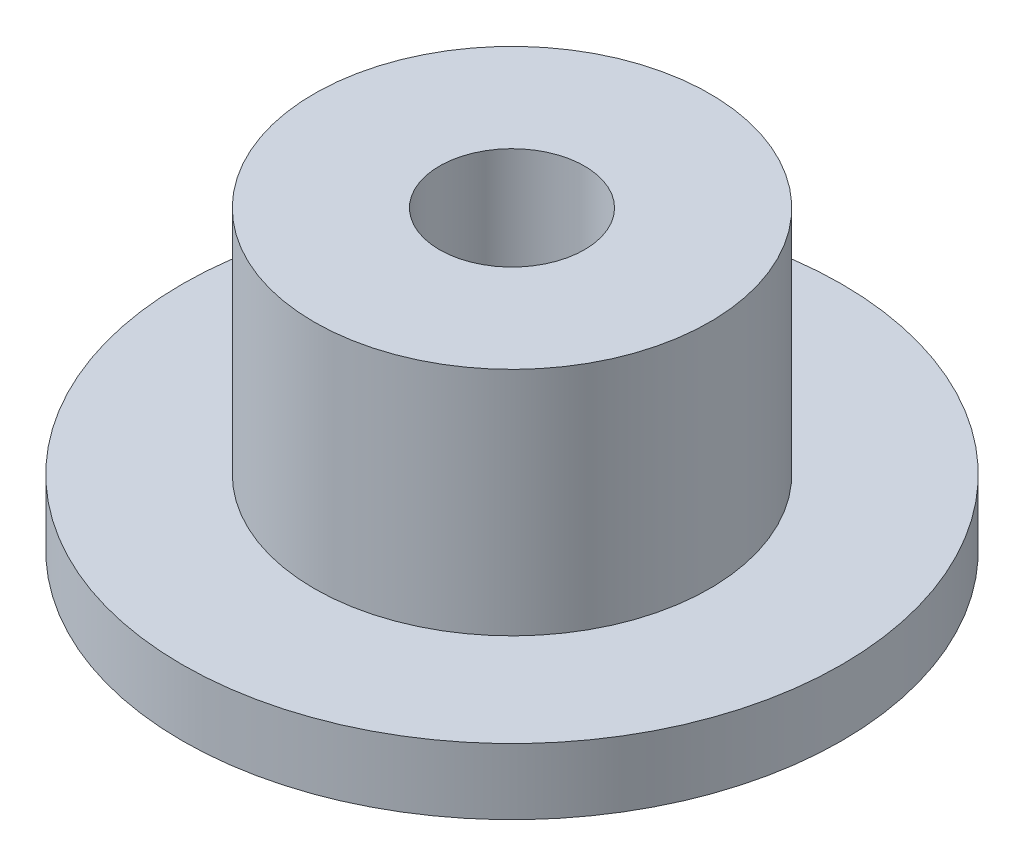
ISO-10303-21;
HEADER;
FILE_DESCRIPTION(('STEP AP214'),'2;1');
FILE_NAME('part.step','',(''),(''),'','','');
FILE_SCHEMA(('AUTOMOTIVE_DESIGN { 1 0 10303 214 1 1 1 1 }'));
ENDSEC;
DATA;
#1=APPLICATION_CONTEXT('core data for automotive mechanical design processes');
#2=APPLICATION_PROTOCOL_DEFINITION('international standard','automotive_design',2000,#1);
#3=PRODUCT_CONTEXT('',#1,'mechanical');
#4=PRODUCT('Part','Part','',(#3));
#5=PRODUCT_RELATED_PRODUCT_CATEGORY('part','',(#4));
#6=PRODUCT_DEFINITION_FORMATION('','',#4);
#7=PRODUCT_DEFINITION_CONTEXT('part definition',#1,'design');
#8=PRODUCT_DEFINITION('design','',#6,#7);
#9=PRODUCT_DEFINITION_SHAPE('','',#8);
#10=(LENGTH_UNIT() NAMED_UNIT(*) SI_UNIT(.MILLI.,.METRE.));
#11=(NAMED_UNIT(*) PLANE_ANGLE_UNIT() SI_UNIT($,.RADIAN.));
#12=(NAMED_UNIT(*) SI_UNIT($,.STERADIAN.) SOLID_ANGLE_UNIT());
#13=UNCERTAINTY_MEASURE_WITH_UNIT(LENGTH_MEASURE(1.E-05),#10,'distance_accuracy_value','');
#14=(GEOMETRIC_REPRESENTATION_CONTEXT(3) GLOBAL_UNCERTAINTY_ASSIGNED_CONTEXT((#13)) GLOBAL_UNIT_ASSIGNED_CONTEXT((#10,
#11,#12)) REPRESENTATION_CONTEXT('',''));
#15=CARTESIAN_POINT('',(0.,0.,0.));
#16=DIRECTION('',(0.,0.,1.));
#17=DIRECTION('',(1.,0.,0.));
#18=AXIS2_PLACEMENT_3D('',#15,#16,#17);
#19=CARTESIAN_POINT('',(6.,9.,0.));
#20=DIRECTION('',(0.,-1.,0.));
#21=DIRECTION('',(0.,0.,-1.));
#22=AXIS2_PLACEMENT_3D('',#19,#20,#21);
#23=PLANE('',#22);
#24=CARTESIAN_POINT('',(0.,9.,0.));
#25=DIRECTION('',(0.,1.,0.));
#26=DIRECTION('',(0.,0.,1.));
#27=AXIS2_PLACEMENT_3D('',#24,#25,#26);
#28=CIRCLE('',#27,2.2);
#29=CARTESIAN_POINT('',(0.,9.,2.2));
#30=VERTEX_POINT('',#29);
#31=EDGE_CURVE('E10',#30,#30,#28,.T.);
#32=ORIENTED_EDGE('',*,*,#31,.F.);
#33=EDGE_LOOP('',(#32));
#34=FACE_BOUND('',#33,.T.);
#35=CARTESIAN_POINT('',(0.,9.,0.));
#36=DIRECTION('',(0.,1.,0.));
#37=DIRECTION('',(0.,0.,1.));
#38=AXIS2_PLACEMENT_3D('',#35,#36,#37);
#39=CIRCLE('',#38,6.);
#40=CARTESIAN_POINT('',(0.,9.,6.));
#41=VERTEX_POINT('',#40);
#42=EDGE_CURVE('E80',#41,#41,#39,.T.);
#43=ORIENTED_EDGE('',*,*,#42,.T.);
#44=EDGE_LOOP('',(#43));
#45=FACE_BOUND('',#44,.T.);
#46=ADVANCED_FACE('F37',(#34,#45),#23,.F.);
#47=CARTESIAN_POINT('',(0.,11.7190903959677,0.));
#48=DIRECTION('',(0.,1.,0.));
#49=DIRECTION('',(0.,0.,1.));
#50=AXIS2_PLACEMENT_3D('',#47,#48,#49);
#51=CYLINDRICAL_SURFACE('',#50,2.2);
#52=CARTESIAN_POINT('',(0.,3.,0.));
#53=DIRECTION('',(0.,1.,0.));
#54=DIRECTION('',(0.,0.,1.));
#55=AXIS2_PLACEMENT_3D('',#52,#53,#54);
#56=CIRCLE('',#55,2.2);
#57=CARTESIAN_POINT('',(0.,3.,2.2));
#58=VERTEX_POINT('',#57);
#59=EDGE_CURVE('E44',#58,#58,#56,.T.);
#60=ORIENTED_EDGE('',*,*,#59,.F.);
#61=EDGE_LOOP('',(#60));
#62=FACE_BOUND('',#61,.T.);
#63=ORIENTED_EDGE('',*,*,#31,.T.);
#64=EDGE_LOOP('',(#63));
#65=FACE_BOUND('',#64,.T.);
#66=ADVANCED_FACE('F130',(#62,#65),#51,.F.);
#67=CARTESIAN_POINT('',(2.2,3.,0.));
#68=DIRECTION('',(0.,1.,0.));
#69=DIRECTION('',(0.,0.,1.));
#70=AXIS2_PLACEMENT_3D('',#67,#68,#69);
#71=PLANE('',#70);
#72=CARTESIAN_POINT('',(0.,3.,0.));
#73=DIRECTION('',(0.,1.,0.));
#74=DIRECTION('',(0.,0.,1.));
#75=AXIS2_PLACEMENT_3D('',#72,#73,#74);
#76=CIRCLE('',#75,4.1);
#77=CARTESIAN_POINT('',(0.,3.,4.1));
#78=VERTEX_POINT('',#77);
#79=EDGE_CURVE('E49',#78,#78,#76,.T.);
#80=ORIENTED_EDGE('',*,*,#79,.F.);
#81=EDGE_LOOP('',(#80));
#82=FACE_BOUND('',#81,.T.);
#83=ORIENTED_EDGE('',*,*,#59,.T.);
#84=EDGE_LOOP('',(#83));
#85=FACE_BOUND('',#84,.T.);
#86=ADVANCED_FACE('F125',(#82,#85),#71,.F.);
#87=CARTESIAN_POINT('',(0.,11.7190903959677,0.));
#88=DIRECTION('',(0.,1.,0.));
#89=DIRECTION('',(0.,0.,1.));
#90=AXIS2_PLACEMENT_3D('',#87,#88,#89);
#91=CYLINDRICAL_SURFACE('',#90,4.1);
#92=CARTESIAN_POINT('',(0.,0.6,0.));
#93=DIRECTION('',(0.,1.,0.));
#94=DIRECTION('',(0.,0.,1.));
#95=AXIS2_PLACEMENT_3D('',#92,#93,#94);
#96=CIRCLE('',#95,4.1);
#97=CARTESIAN_POINT('',(0.,0.6,4.1));
#98=VERTEX_POINT('',#97);
#99=EDGE_CURVE('E54',#98,#98,#96,.T.);
#100=ORIENTED_EDGE('',*,*,#99,.F.);
#101=EDGE_LOOP('',(#100));
#102=FACE_BOUND('',#101,.T.);
#103=ORIENTED_EDGE('',*,*,#79,.T.);
#104=EDGE_LOOP('',(#103));
#105=FACE_BOUND('',#104,.T.);
#106=ADVANCED_FACE('F119',(#102,#105),#91,.F.);
#107=CARTESIAN_POINT('',(4.1,0.6,0.));
#108=DIRECTION('',(0.,1.,0.));
#109=DIRECTION('',(0.,0.,1.));
#110=AXIS2_PLACEMENT_3D('',#107,#108,#109);
#111=PLANE('',#110);
#112=CARTESIAN_POINT('',(0.,0.6,0.));
#113=DIRECTION('',(0.,1.,0.));
#114=DIRECTION('',(0.,0.,1.));
#115=AXIS2_PLACEMENT_3D('',#112,#113,#114);
#116=CIRCLE('',#115,4.65);
#117=CARTESIAN_POINT('',(0.,0.6,4.65));
#118=VERTEX_POINT('',#117);
#119=EDGE_CURVE('E60',#118,#118,#116,.T.);
#120=ORIENTED_EDGE('',*,*,#119,.F.);
#121=EDGE_LOOP('',(#120));
#122=FACE_BOUND('',#121,.T.);
#123=ORIENTED_EDGE('',*,*,#99,.T.);
#124=EDGE_LOOP('',(#123));
#125=FACE_BOUND('',#124,.T.);
#126=ADVANCED_FACE('F113',(#122,#125),#111,.F.);
#127=CARTESIAN_POINT('',(0.,11.7190903959677,0.));
#128=DIRECTION('',(0.,1.,0.));
#129=DIRECTION('',(0.,0.,1.));
#130=AXIS2_PLACEMENT_3D('',#127,#128,#129);
#131=CYLINDRICAL_SURFACE('',#130,4.65);
#132=CARTESIAN_POINT('',(0.,0.,0.));
#133=DIRECTION('',(0.,1.,0.));
#134=DIRECTION('',(0.,0.,1.));
#135=AXIS2_PLACEMENT_3D('',#132,#133,#134);
#136=CIRCLE('',#135,4.65);
#137=CARTESIAN_POINT('',(0.,0.,4.65));
#138=VERTEX_POINT('',#137);
#139=EDGE_CURVE('E64',#138,#138,#136,.T.);
#140=ORIENTED_EDGE('',*,*,#139,.F.);
#141=EDGE_LOOP('',(#140));
#142=FACE_BOUND('',#141,.T.);
#143=ORIENTED_EDGE('',*,*,#119,.T.);
#144=EDGE_LOOP('',(#143));
#145=FACE_BOUND('',#144,.T.);
#146=ADVANCED_FACE('F107',(#142,#145),#131,.F.);
#147=CARTESIAN_POINT('',(4.65,0.,0.));
#148=DIRECTION('',(0.,1.,0.));
#149=DIRECTION('',(0.,0.,1.));
#150=AXIS2_PLACEMENT_3D('',#147,#148,#149);
#151=PLANE('',#150);
#152=CARTESIAN_POINT('',(0.,0.,0.));
#153=DIRECTION('',(0.,1.,0.));
#154=DIRECTION('',(0.,0.,1.));
#155=AXIS2_PLACEMENT_3D('',#152,#153,#154);
#156=CIRCLE('',#155,10.);
#157=CARTESIAN_POINT('',(0.,0.,10.));
#158=VERTEX_POINT('',#157);
#159=EDGE_CURVE('E68',#158,#158,#156,.T.);
#160=ORIENTED_EDGE('',*,*,#159,.F.);
#161=EDGE_LOOP('',(#160));
#162=FACE_BOUND('',#161,.T.);
#163=ORIENTED_EDGE('',*,*,#139,.T.);
#164=EDGE_LOOP('',(#163));
#165=FACE_BOUND('',#164,.T.);
#166=ADVANCED_FACE('F101',(#162,#165),#151,.F.);
#167=CARTESIAN_POINT('',(0.,11.7190903959677,0.));
#168=DIRECTION('',(0.,1.,0.));
#169=DIRECTION('',(0.,0.,1.));
#170=AXIS2_PLACEMENT_3D('',#167,#168,#169);
#171=CYLINDRICAL_SURFACE('',#170,10.);
#172=CARTESIAN_POINT('',(0.,2.,0.));
#173=DIRECTION('',(0.,1.,0.));
#174=DIRECTION('',(0.,0.,1.));
#175=AXIS2_PLACEMENT_3D('',#172,#173,#174);
#176=CIRCLE('',#175,10.);
#177=CARTESIAN_POINT('',(0.,2.,10.));
#178=VERTEX_POINT('',#177);
#179=EDGE_CURVE('E72',#178,#178,#176,.T.);
#180=ORIENTED_EDGE('',*,*,#179,.F.);
#181=EDGE_LOOP('',(#180));
#182=FACE_BOUND('',#181,.T.);
#183=ORIENTED_EDGE('',*,*,#159,.T.);
#184=EDGE_LOOP('',(#183));
#185=FACE_BOUND('',#184,.T.);
#186=ADVANCED_FACE('F95',(#182,#185),#171,.T.);
#187=CARTESIAN_POINT('',(10.,2.,0.));
#188=DIRECTION('',(0.,-1.,0.));
#189=DIRECTION('',(0.,0.,-1.));
#190=AXIS2_PLACEMENT_3D('',#187,#188,#189);
#191=PLANE('',#190);
#192=CARTESIAN_POINT('',(0.,2.,0.));
#193=DIRECTION('',(0.,1.,0.));
#194=DIRECTION('',(0.,0.,1.));
#195=AXIS2_PLACEMENT_3D('',#192,#193,#194);
#196=CIRCLE('',#195,6.);
#197=CARTESIAN_POINT('',(0.,2.,6.));
#198=VERTEX_POINT('',#197);
#199=EDGE_CURVE('E76',#198,#198,#196,.T.);
#200=ORIENTED_EDGE('',*,*,#199,.F.);
#201=EDGE_LOOP('',(#200));
#202=FACE_BOUND('',#201,.T.);
#203=ORIENTED_EDGE('',*,*,#179,.T.);
#204=EDGE_LOOP('',(#203));
#205=FACE_BOUND('',#204,.T.);
#206=ADVANCED_FACE('F89',(#202,#205),#191,.F.);
#207=CARTESIAN_POINT('',(0.,11.7190903959677,0.));
#208=DIRECTION('',(0.,1.,0.));
#209=DIRECTION('',(0.,0.,1.));
#210=AXIS2_PLACEMENT_3D('',#207,#208,#209);
#211=CYLINDRICAL_SURFACE('',#210,6.);
#212=ORIENTED_EDGE('',*,*,#42,.F.);
#213=EDGE_LOOP('',(#212));
#214=FACE_BOUND('',#213,.T.);
#215=ORIENTED_EDGE('',*,*,#199,.T.);
#216=EDGE_LOOP('',(#215));
#217=FACE_BOUND('',#216,.T.);
#218=ADVANCED_FACE('F86',(#214,#217),#211,.T.);
#219=CLOSED_SHELL('',(#46,#66,#86,#106,#126,#146,#166,#186,#206,#218));
#220=MANIFOLD_SOLID_BREP('B2',#219);
#221=ADVANCED_BREP_SHAPE_REPRESENTATION('',(#18,#220),#14);
#222=SHAPE_DEFINITION_REPRESENTATION(#9,#221);
ENDSEC;
END-ISO-10303-21;
